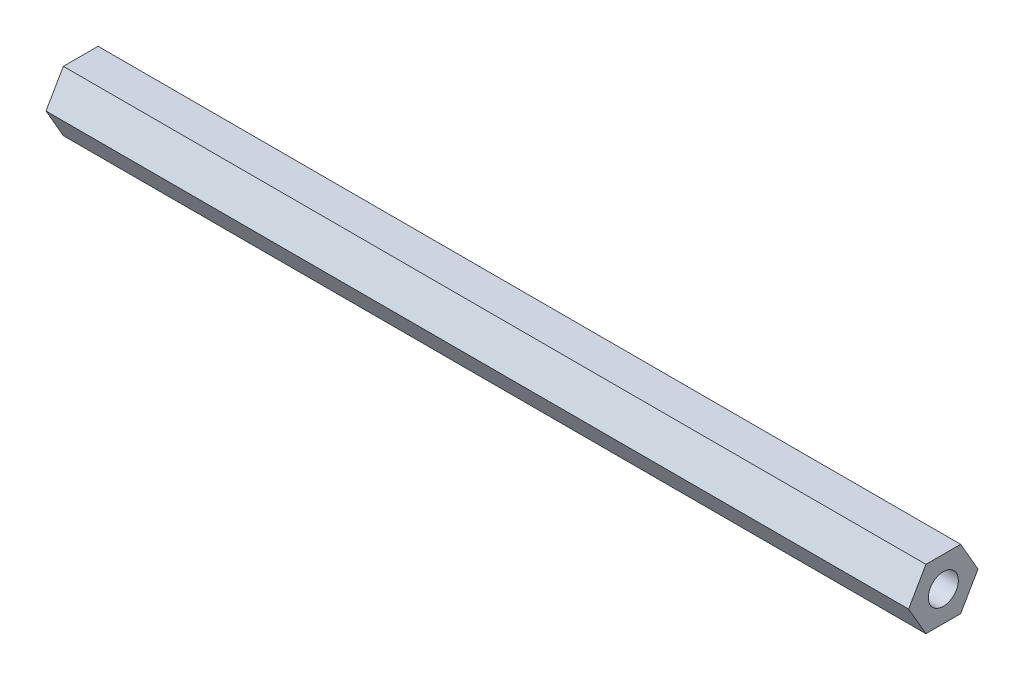
ISO-10303-21;
HEADER;
FILE_DESCRIPTION(('STEP AP214'),'2;1');
FILE_NAME('part.step','',(''),(''),'','','');
FILE_SCHEMA(('AUTOMOTIVE_DESIGN { 1 0 10303 214 1 1 1 1 }'));
ENDSEC;
DATA;
#1=APPLICATION_CONTEXT('core data for automotive mechanical design processes');
#2=APPLICATION_PROTOCOL_DEFINITION('international standard','automotive_design',2000,#1);
#3=PRODUCT_CONTEXT('',#1,'mechanical');
#4=PRODUCT('Part','Part','',(#3));
#5=PRODUCT_RELATED_PRODUCT_CATEGORY('part','',(#4));
#6=PRODUCT_DEFINITION_FORMATION('','',#4);
#7=PRODUCT_DEFINITION_CONTEXT('part definition',#1,'design');
#8=PRODUCT_DEFINITION('design','',#6,#7);
#9=PRODUCT_DEFINITION_SHAPE('','',#8);
#10=(LENGTH_UNIT() NAMED_UNIT(*) SI_UNIT(.MILLI.,.METRE.));
#11=(NAMED_UNIT(*) PLANE_ANGLE_UNIT() SI_UNIT($,.RADIAN.));
#12=(NAMED_UNIT(*) SI_UNIT($,.STERADIAN.) SOLID_ANGLE_UNIT());
#13=UNCERTAINTY_MEASURE_WITH_UNIT(LENGTH_MEASURE(1.E-05),#10,'distance_accuracy_value','');
#14=(GEOMETRIC_REPRESENTATION_CONTEXT(3) GLOBAL_UNCERTAINTY_ASSIGNED_CONTEXT((#13)) GLOBAL_UNIT_ASSIGNED_CONTEXT((#10,
#11,#12)) REPRESENTATION_CONTEXT('',''));
#15=CARTESIAN_POINT('',(0.,0.,0.));
#16=DIRECTION('',(0.,0.,1.));
#17=DIRECTION('',(1.,0.,0.));
#18=AXIS2_PLACEMENT_3D('',#15,#16,#17);
#19=CARTESIAN_POINT('',(71.755,0.,-2.88675134594813));
#20=DIRECTION('',(0.,-0.5,0.866025403784439));
#21=DIRECTION('',(0.,-0.866025403784439,-0.5));
#22=AXIS2_PLACEMENT_3D('',#19,#20,#21);
#23=PLANE('',#22);
#24=DIRECTION('',(0.,0.866025403784439,0.5));
#25=VECTOR('',#24,1.);
#26=CARTESIAN_POINT('',(0.,0.,-2.88675134594813));
#27=LINE('',#26,#25);
#28=CARTESIAN_POINT('',(0.,0.,-2.88675134594813));
#29=VERTEX_POINT('',#28);
#30=CARTESIAN_POINT('',(0.,2.5,-1.44337567297406));
#31=VERTEX_POINT('',#30);
#32=EDGE_CURVE('E158',#29,#31,#27,.T.);
#33=ORIENTED_EDGE('',*,*,#32,.T.);
#34=DIRECTION('',(-1.,0.,0.));
#35=VECTOR('',#34,1.);
#36=CARTESIAN_POINT('',(71.755,2.5,-1.44337567297406));
#37=LINE('',#36,#35);
#38=CARTESIAN_POINT('',(71.755,2.5,-1.44337567297406));
#39=VERTEX_POINT('',#38);
#40=EDGE_CURVE('E13',#39,#31,#37,.T.);
#41=ORIENTED_EDGE('',*,*,#40,.F.);
#42=DIRECTION('',(0.,0.866025403784439,0.5));
#43=VECTOR('',#42,1.);
#44=CARTESIAN_POINT('',(71.755,0.,-2.88675134594813));
#45=LINE('',#44,#43);
#46=CARTESIAN_POINT('',(71.755,0.,-2.88675134594813));
#47=VERTEX_POINT('',#46);
#48=EDGE_CURVE('E175',#47,#39,#45,.T.);
#49=ORIENTED_EDGE('',*,*,#48,.F.);
#50=DIRECTION('',(-1.,0.,0.));
#51=VECTOR('',#50,1.);
#52=CARTESIAN_POINT('',(71.755,0.,-2.88675134594813));
#53=LINE('',#52,#51);
#54=EDGE_CURVE('E154',#47,#29,#53,.T.);
#55=ORIENTED_EDGE('',*,*,#54,.T.);
#56=EDGE_LOOP('',(#33,#41,#49,#55));
#57=FACE_BOUND('',#56,.T.);
#58=ADVANCED_FACE('F65',(#57),#23,.F.);
#59=CARTESIAN_POINT('',(71.755,2.5,-1.44337567297406));
#60=DIRECTION('',(0.,-1.,0.));
#61=DIRECTION('',(0.,0.,-1.));
#62=AXIS2_PLACEMENT_3D('',#59,#60,#61);
#63=PLANE('',#62);
#64=DIRECTION('',(0.,0.,1.));
#65=VECTOR('',#64,1.);
#66=CARTESIAN_POINT('',(0.,2.5,-1.44337567297406));
#67=LINE('',#66,#65);
#68=CARTESIAN_POINT('',(0.,2.5,1.44337567297406));
#69=VERTEX_POINT('',#68);
#70=EDGE_CURVE('E162',#31,#69,#67,.T.);
#71=ORIENTED_EDGE('',*,*,#70,.T.);
#72=DIRECTION('',(-1.,0.,0.));
#73=VECTOR('',#72,1.);
#74=CARTESIAN_POINT('',(71.755,2.5,1.44337567297406));
#75=LINE('',#74,#73);
#76=CARTESIAN_POINT('',(71.755,2.5,1.44337567297406));
#77=VERTEX_POINT('',#76);
#78=EDGE_CURVE('E74',#77,#69,#75,.T.);
#79=ORIENTED_EDGE('',*,*,#78,.F.);
#80=DIRECTION('',(0.,0.,1.));
#81=VECTOR('',#80,1.);
#82=CARTESIAN_POINT('',(71.755,2.5,-1.44337567297406));
#83=LINE('',#82,#81);
#84=EDGE_CURVE('E120',#39,#77,#83,.T.);
#85=ORIENTED_EDGE('',*,*,#84,.F.);
#86=ORIENTED_EDGE('',*,*,#40,.T.);
#87=EDGE_LOOP('',(#71,#79,#85,#86));
#88=FACE_BOUND('',#87,.T.);
#89=ADVANCED_FACE('F206',(#88),#63,.F.);
#90=CARTESIAN_POINT('',(71.755,2.5,1.44337567297406));
#91=DIRECTION('',(0.,-0.5,-0.866025403784439));
#92=DIRECTION('',(0.,0.866025403784439,-0.5));
#93=AXIS2_PLACEMENT_3D('',#90,#91,#92);
#94=PLANE('',#93);
#95=DIRECTION('',(0.,-0.866025403784439,0.5));
#96=VECTOR('',#95,1.);
#97=CARTESIAN_POINT('',(0.,2.5,1.44337567297406));
#98=LINE('',#97,#96);
#99=CARTESIAN_POINT('',(0.,0.,2.88675134594813));
#100=VERTEX_POINT('',#99);
#101=EDGE_CURVE('E166',#69,#100,#98,.T.);
#102=ORIENTED_EDGE('',*,*,#101,.T.);
#103=DIRECTION('',(-1.,0.,0.));
#104=VECTOR('',#103,1.);
#105=CARTESIAN_POINT('',(71.755,0.,2.88675134594813));
#106=LINE('',#105,#104);
#107=CARTESIAN_POINT('',(71.755,0.,2.88675134594813));
#108=VERTEX_POINT('',#107);
#109=EDGE_CURVE('E146',#108,#100,#106,.T.);
#110=ORIENTED_EDGE('',*,*,#109,.F.);
#111=DIRECTION('',(0.,-0.866025403784439,0.5));
#112=VECTOR('',#111,1.);
#113=CARTESIAN_POINT('',(71.755,2.5,1.44337567297406));
#114=LINE('',#113,#112);
#115=EDGE_CURVE('E135',#77,#108,#114,.T.);
#116=ORIENTED_EDGE('',*,*,#115,.F.);
#117=ORIENTED_EDGE('',*,*,#78,.T.);
#118=EDGE_LOOP('',(#102,#110,#116,#117));
#119=FACE_BOUND('',#118,.T.);
#120=ADVANCED_FACE('F186',(#119),#94,.F.);
#121=CARTESIAN_POINT('',(71.755,0.,2.88675134594813));
#122=DIRECTION('',(0.,0.5,-0.866025403784439));
#123=DIRECTION('',(0.,0.866025403784438,0.5));
#124=AXIS2_PLACEMENT_3D('',#121,#122,#123);
#125=PLANE('',#124);
#126=DIRECTION('',(0.,-0.866025403784439,-0.5));
#127=VECTOR('',#126,1.);
#128=CARTESIAN_POINT('',(0.,0.,2.88675134594813));
#129=LINE('',#128,#127);
#130=CARTESIAN_POINT('',(0.,-2.5,1.44337567297406));
#131=VERTEX_POINT('',#130);
#132=EDGE_CURVE('E144',#100,#131,#129,.T.);
#133=ORIENTED_EDGE('',*,*,#132,.T.);
#134=DIRECTION('',(-1.,0.,0.));
#135=VECTOR('',#134,1.);
#136=CARTESIAN_POINT('',(71.755,-2.5,1.44337567297406));
#137=LINE('',#136,#135);
#138=CARTESIAN_POINT('',(71.755,-2.5,1.44337567297406));
#139=VERTEX_POINT('',#138);
#140=EDGE_CURVE('E141',#139,#131,#137,.T.);
#141=ORIENTED_EDGE('',*,*,#140,.F.);
#142=DIRECTION('',(0.,-0.866025403784439,-0.5));
#143=VECTOR('',#142,1.);
#144=CARTESIAN_POINT('',(71.755,0.,2.88675134594813));
#145=LINE('',#144,#143);
#146=EDGE_CURVE('E129',#108,#139,#145,.T.);
#147=ORIENTED_EDGE('',*,*,#146,.F.);
#148=ORIENTED_EDGE('',*,*,#109,.T.);
#149=EDGE_LOOP('',(#133,#141,#147,#148));
#150=FACE_BOUND('',#149,.T.);
#151=ADVANCED_FACE('F142',(#150),#125,.F.);
#152=CARTESIAN_POINT('',(71.755,-2.5,1.44337567297406));
#153=DIRECTION('',(0.,1.,0.));
#154=DIRECTION('',(0.,0.,1.));
#155=AXIS2_PLACEMENT_3D('',#152,#153,#154);
#156=PLANE('',#155);
#157=DIRECTION('',(0.,0.,-1.));
#158=VECTOR('',#157,1.);
#159=CARTESIAN_POINT('',(0.,-2.5,1.44337567297406));
#160=LINE('',#159,#158);
#161=CARTESIAN_POINT('',(0.,-2.5,-1.44337567297406));
#162=VERTEX_POINT('',#161);
#163=EDGE_CURVE('E106',#131,#162,#160,.T.);
#164=ORIENTED_EDGE('',*,*,#163,.T.);
#165=DIRECTION('',(-1.,0.,0.));
#166=VECTOR('',#165,1.);
#167=CARTESIAN_POINT('',(71.755,-2.5,-1.44337567297406));
#168=LINE('',#167,#166);
#169=CARTESIAN_POINT('',(71.755,-2.5,-1.44337567297406));
#170=VERTEX_POINT('',#169);
#171=EDGE_CURVE('E147',#170,#162,#168,.T.);
#172=ORIENTED_EDGE('',*,*,#171,.F.);
#173=DIRECTION('',(0.,0.,-1.));
#174=VECTOR('',#173,1.);
#175=CARTESIAN_POINT('',(71.755,-2.5,1.44337567297406));
#176=LINE('',#175,#174);
#177=EDGE_CURVE('E133',#139,#170,#176,.T.);
#178=ORIENTED_EDGE('',*,*,#177,.F.);
#179=ORIENTED_EDGE('',*,*,#140,.T.);
#180=EDGE_LOOP('',(#164,#172,#178,#179));
#181=FACE_BOUND('',#180,.T.);
#182=ADVANCED_FACE('F149',(#181),#156,.F.);
#183=CARTESIAN_POINT('',(71.755,-2.5,-1.44337567297406));
#184=DIRECTION('',(0.,0.5,0.866025403784439));
#185=DIRECTION('',(0.,-0.866025403784439,0.5));
#186=AXIS2_PLACEMENT_3D('',#183,#184,#185);
#187=PLANE('',#186);
#188=DIRECTION('',(0.,0.866025403784439,-0.5));
#189=VECTOR('',#188,1.);
#190=CARTESIAN_POINT('',(0.,-2.5,-1.44337567297406));
#191=LINE('',#190,#189);
#192=EDGE_CURVE('E112',#162,#29,#191,.T.);
#193=ORIENTED_EDGE('',*,*,#192,.T.);
#194=ORIENTED_EDGE('',*,*,#54,.F.);
#195=DIRECTION('',(0.,0.866025403784439,-0.5));
#196=VECTOR('',#195,1.);
#197=CARTESIAN_POINT('',(71.755,-2.5,-1.44337567297406));
#198=LINE('',#197,#196);
#199=EDGE_CURVE('E82',#170,#47,#198,.T.);
#200=ORIENTED_EDGE('',*,*,#199,.F.);
#201=ORIENTED_EDGE('',*,*,#171,.T.);
#202=EDGE_LOOP('',(#193,#194,#200,#201));
#203=FACE_BOUND('',#202,.T.);
#204=ADVANCED_FACE('F193',(#203),#187,.F.);
#205=CARTESIAN_POINT('',(71.755,0.,0.));
#206=DIRECTION('',(1.,0.,0.));
#207=DIRECTION('',(0.,0.,-1.));
#208=AXIS2_PLACEMENT_3D('',#205,#206,#207);
#209=PLANE('',#208);
#210=CARTESIAN_POINT('',(71.755,0.,0.));
#211=DIRECTION('',(1.,0.,0.));
#212=DIRECTION('',(0.,0.,-1.));
#213=AXIS2_PLACEMENT_3D('',#210,#211,#212);
#214=CIRCLE('',#213,1.24999999999999);
#215=CARTESIAN_POINT('',(71.755,0.,-1.24999999999999));
#216=VERTEX_POINT('',#215);
#217=EDGE_CURVE('E322',#216,#216,#214,.T.);
#218=ORIENTED_EDGE('',*,*,#217,.F.);
#219=EDGE_LOOP('',(#218));
#220=FACE_BOUND('',#219,.T.);
#221=ORIENTED_EDGE('',*,*,#48,.T.);
#222=ORIENTED_EDGE('',*,*,#84,.T.);
#223=ORIENTED_EDGE('',*,*,#115,.T.);
#224=ORIENTED_EDGE('',*,*,#146,.T.);
#225=ORIENTED_EDGE('',*,*,#177,.T.);
#226=ORIENTED_EDGE('',*,*,#199,.T.);
#227=EDGE_LOOP('',(#221,#222,#223,#224,#225,#226));
#228=FACE_BOUND('',#227,.T.);
#229=ADVANCED_FACE('F131',(#220,#228),#209,.T.);
#230=CARTESIAN_POINT('',(0.,0.,0.));
#231=DIRECTION('',(1.,0.,0.));
#232=DIRECTION('',(0.,0.,-1.));
#233=AXIS2_PLACEMENT_3D('',#230,#231,#232);
#234=PLANE('',#233);
#235=CARTESIAN_POINT('',(0.,0.,0.));
#236=DIRECTION('',(-1.,0.,0.));
#237=DIRECTION('',(0.,0.,1.));
#238=AXIS2_PLACEMENT_3D('',#235,#236,#237);
#239=CIRCLE('',#238,1.24999999999999);
#240=CARTESIAN_POINT('',(0.,0.,1.24999999999999));
#241=VERTEX_POINT('',#240);
#242=EDGE_CURVE('E327',#241,#241,#239,.T.);
#243=ORIENTED_EDGE('',*,*,#242,.F.);
#244=EDGE_LOOP('',(#243));
#245=FACE_BOUND('',#244,.T.);
#246=ORIENTED_EDGE('',*,*,#32,.F.);
#247=ORIENTED_EDGE('',*,*,#192,.F.);
#248=ORIENTED_EDGE('',*,*,#163,.F.);
#249=ORIENTED_EDGE('',*,*,#132,.F.);
#250=ORIENTED_EDGE('',*,*,#101,.F.);
#251=ORIENTED_EDGE('',*,*,#70,.F.);
#252=EDGE_LOOP('',(#246,#247,#248,#249,#250,#251));
#253=FACE_BOUND('',#252,.T.);
#254=ADVANCED_FACE('F189',(#245,#253),#234,.F.);
#255=CARTESIAN_POINT('',(7.493,0.,0.));
#256=DIRECTION('',(-1.,0.,0.));
#257=DIRECTION('',(0.,0.,1.));
#258=AXIS2_PLACEMENT_3D('',#255,#256,#257);
#259=CONICAL_SURFACE('',#258,1.24999999999999,1.02974425867665);
#260=CARTESIAN_POINT('',(8.24407577378444,0.,0.));
#261=VERTEX_POINT('',#260);
#262=VERTEX_LOOP('',#261);
#263=FACE_BOUND('',#262,.T.);
#264=CARTESIAN_POINT('',(7.493,0.,0.));
#265=DIRECTION('',(-1.,0.,0.));
#266=DIRECTION('',(0.,0.,1.));
#267=AXIS2_PLACEMENT_3D('',#264,#265,#266);
#268=CIRCLE('',#267,1.24999999999999);
#269=CARTESIAN_POINT('',(7.493,0.,1.24999999999999));
#270=VERTEX_POINT('',#269);
#271=EDGE_CURVE('E163',#270,#270,#268,.T.);
#272=ORIENTED_EDGE('',*,*,#271,.T.);
#273=EDGE_LOOP('',(#272));
#274=FACE_BOUND('',#273,.T.);
#275=ADVANCED_FACE('F249',(#263,#274),#259,.F.);
#276=CARTESIAN_POINT('',(0.,0.,0.));
#277=DIRECTION('',(-1.,0.,0.));
#278=DIRECTION('',(0.,0.,1.));
#279=AXIS2_PLACEMENT_3D('',#276,#277,#278);
#280=CYLINDRICAL_SURFACE('',#279,1.24999999999999);
#281=ORIENTED_EDGE('',*,*,#271,.F.);
#282=EDGE_LOOP('',(#281));
#283=FACE_BOUND('',#282,.T.);
#284=ORIENTED_EDGE('',*,*,#242,.T.);
#285=EDGE_LOOP('',(#284));
#286=FACE_BOUND('',#285,.T.);
#287=ADVANCED_FACE('F259',(#283,#286),#280,.F.);
#288=CARTESIAN_POINT('',(64.262,0.,0.));
#289=DIRECTION('',(1.,0.,0.));
#290=DIRECTION('',(0.,0.,-1.));
#291=AXIS2_PLACEMENT_3D('',#288,#289,#290);
#292=CONICAL_SURFACE('',#291,1.24999999999999,1.02974425867665);
#293=CARTESIAN_POINT('',(63.5109242262156,0.,0.));
#294=VERTEX_POINT('',#293);
#295=VERTEX_LOOP('',#294);
#296=FACE_BOUND('',#295,.T.);
#297=CARTESIAN_POINT('',(64.262,0.,0.));
#298=DIRECTION('',(1.,0.,0.));
#299=DIRECTION('',(0.,0.,-1.));
#300=AXIS2_PLACEMENT_3D('',#297,#298,#299);
#301=CIRCLE('',#300,1.24999999999999);
#302=CARTESIAN_POINT('',(64.262,0.,-1.24999999999999));
#303=VERTEX_POINT('',#302);
#304=EDGE_CURVE('E319',#303,#303,#301,.T.);
#305=ORIENTED_EDGE('',*,*,#304,.T.);
#306=EDGE_LOOP('',(#305));
#307=FACE_BOUND('',#306,.T.);
#308=ADVANCED_FACE('F269',(#296,#307),#292,.F.);
#309=CARTESIAN_POINT('',(71.755,0.,0.));
#310=DIRECTION('',(1.,0.,0.));
#311=DIRECTION('',(0.,0.,-1.));
#312=AXIS2_PLACEMENT_3D('',#309,#310,#311);
#313=CYLINDRICAL_SURFACE('',#312,1.24999999999999);
#314=ORIENTED_EDGE('',*,*,#304,.F.);
#315=EDGE_LOOP('',(#314));
#316=FACE_BOUND('',#315,.T.);
#317=ORIENTED_EDGE('',*,*,#217,.T.);
#318=EDGE_LOOP('',(#317));
#319=FACE_BOUND('',#318,.T.);
#320=ADVANCED_FACE('F279',(#316,#319),#313,.F.);
#321=CLOSED_SHELL('',(#58,#89,#120,#151,#182,#204,#229,#254,#275,#287,#308,#320));
#322=MANIFOLD_SOLID_BREP('B2',#321);
#323=ADVANCED_BREP_SHAPE_REPRESENTATION('',(#18,#322),#14);
#324=SHAPE_DEFINITION_REPRESENTATION(#9,#323);
ENDSEC;
END-ISO-10303-21;
